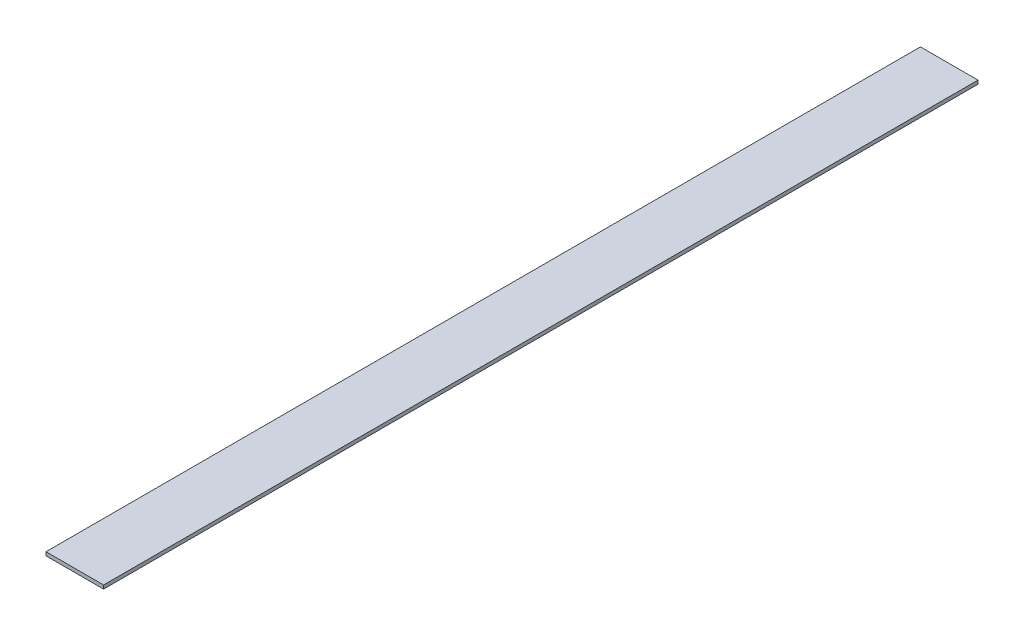
ISO-10303-21;
HEADER;
FILE_DESCRIPTION(('STEP AP214'),'2;1');
FILE_NAME('part.step','',(''),(''),'','','');
FILE_SCHEMA(('AUTOMOTIVE_DESIGN { 1 0 10303 214 1 1 1 1 }'));
ENDSEC;
DATA;
#1=APPLICATION_CONTEXT('core data for automotive mechanical design processes');
#2=APPLICATION_PROTOCOL_DEFINITION('international standard','automotive_design',2000,#1);
#3=PRODUCT_CONTEXT('',#1,'mechanical');
#4=PRODUCT('Part','Part','',(#3));
#5=PRODUCT_RELATED_PRODUCT_CATEGORY('part','',(#4));
#6=PRODUCT_DEFINITION_FORMATION('','',#4);
#7=PRODUCT_DEFINITION_CONTEXT('part definition',#1,'design');
#8=PRODUCT_DEFINITION('design','',#6,#7);
#9=PRODUCT_DEFINITION_SHAPE('','',#8);
#10=(LENGTH_UNIT() NAMED_UNIT(*) SI_UNIT(.MILLI.,.METRE.));
#11=(NAMED_UNIT(*) PLANE_ANGLE_UNIT() SI_UNIT($,.RADIAN.));
#12=(NAMED_UNIT(*) SI_UNIT($,.STERADIAN.) SOLID_ANGLE_UNIT());
#13=UNCERTAINTY_MEASURE_WITH_UNIT(LENGTH_MEASURE(1.E-05),#10,'distance_accuracy_value','');
#14=(GEOMETRIC_REPRESENTATION_CONTEXT(3) GLOBAL_UNCERTAINTY_ASSIGNED_CONTEXT((#13)) GLOBAL_UNIT_ASSIGNED_CONTEXT((#10,
#11,#12)) REPRESENTATION_CONTEXT('',''));
#15=CARTESIAN_POINT('',(0.,0.,0.));
#16=DIRECTION('',(0.,0.,1.));
#17=DIRECTION('',(1.,0.,0.));
#18=AXIS2_PLACEMENT_3D('',#15,#16,#17);
#19=CARTESIAN_POINT('',(0.,3.175,0.));
#20=DIRECTION('',(0.,1.,0.));
#21=DIRECTION('',(0.,0.,1.));
#22=AXIS2_PLACEMENT_3D('',#19,#20,#21);
#23=PLANE('',#22);
#24=DIRECTION('',(-1.,0.,0.));
#25=VECTOR('',#24,1.);
#26=CARTESIAN_POINT('',(25.4,3.175,-379.4125));
#27=LINE('',#26,#25);
#28=CARTESIAN_POINT('',(-25.4,3.175,-379.4125));
#29=VERTEX_POINT('',#28);
#30=CARTESIAN_POINT('',(25.4,3.175,-379.4125));
#31=VERTEX_POINT('',#30);
#32=EDGE_CURVE('E67',#29,#31,#27,.F.);
#33=ORIENTED_EDGE('',*,*,#32,.F.);
#34=DIRECTION('',(0.,0.,1.));
#35=VECTOR('',#34,1.);
#36=CARTESIAN_POINT('',(-25.4,3.175,-379.4125));
#37=LINE('',#36,#35);
#38=CARTESIAN_POINT('',(-25.4,3.175,392.1125));
#39=VERTEX_POINT('',#38);
#40=EDGE_CURVE('E19',#39,#29,#37,.F.);
#41=ORIENTED_EDGE('',*,*,#40,.F.);
#42=DIRECTION('',(1.,0.,0.));
#43=VECTOR('',#42,1.);
#44=CARTESIAN_POINT('',(-25.4,3.175,392.1125));
#45=LINE('',#44,#43);
#46=CARTESIAN_POINT('',(25.4,3.175,392.1125));
#47=VERTEX_POINT('',#46);
#48=EDGE_CURVE('E57',#47,#39,#45,.F.);
#49=ORIENTED_EDGE('',*,*,#48,.F.);
#50=DIRECTION('',(0.,0.,-1.));
#51=VECTOR('',#50,1.);
#52=CARTESIAN_POINT('',(25.4,3.175,392.1125));
#53=LINE('',#52,#51);
#54=EDGE_CURVE('E52',#31,#47,#53,.F.);
#55=ORIENTED_EDGE('',*,*,#54,.F.);
#56=EDGE_LOOP('',(#33,#41,#49,#55));
#57=FACE_BOUND('',#56,.T.);
#58=ADVANCED_FACE('F16',(#57),#23,.T.);
#59=CARTESIAN_POINT('',(-25.4,0.,-379.4125));
#60=DIRECTION('',(-1.,0.,0.));
#61=DIRECTION('',(0.,0.,1.));
#62=AXIS2_PLACEMENT_3D('',#59,#60,#61);
#63=PLANE('',#62);
#64=DIRECTION('',(0.,1.,0.));
#65=VECTOR('',#64,1.);
#66=CARTESIAN_POINT('',(-25.4,0.,-379.4125));
#67=LINE('',#66,#65);
#68=CARTESIAN_POINT('',(-25.4,0.,-379.4125));
#69=VERTEX_POINT('',#68);
#70=EDGE_CURVE('E78',#69,#29,#67,.T.);
#71=ORIENTED_EDGE('',*,*,#70,.F.);
#72=DIRECTION('',(0.,0.,1.));
#73=VECTOR('',#72,1.);
#74=CARTESIAN_POINT('',(-25.4,0.,0.));
#75=LINE('',#74,#73);
#76=CARTESIAN_POINT('',(-25.4,0.,392.1125));
#77=VERTEX_POINT('',#76);
#78=EDGE_CURVE('E73',#69,#77,#75,.T.);
#79=ORIENTED_EDGE('',*,*,#78,.T.);
#80=DIRECTION('',(0.,1.,0.));
#81=VECTOR('',#80,1.);
#82=CARTESIAN_POINT('',(-25.4,0.,392.1125));
#83=LINE('',#82,#81);
#84=EDGE_CURVE('E62',#39,#77,#83,.F.);
#85=ORIENTED_EDGE('',*,*,#84,.F.);
#86=ORIENTED_EDGE('',*,*,#40,.T.);
#87=EDGE_LOOP('',(#71,#79,#85,#86));
#88=FACE_BOUND('',#87,.T.);
#89=ADVANCED_FACE('F72',(#88),#63,.T.);
#90=CARTESIAN_POINT('',(-25.4,0.,392.1125));
#91=DIRECTION('',(0.,0.,1.));
#92=DIRECTION('',(1.,0.,0.));
#93=AXIS2_PLACEMENT_3D('',#90,#91,#92);
#94=PLANE('',#93);
#95=ORIENTED_EDGE('',*,*,#84,.T.);
#96=DIRECTION('',(1.,0.,0.));
#97=VECTOR('',#96,1.);
#98=CARTESIAN_POINT('',(0.,0.,392.1125));
#99=LINE('',#98,#97);
#100=CARTESIAN_POINT('',(25.4,0.,392.1125));
#101=VERTEX_POINT('',#100);
#102=EDGE_CURVE('E83',#77,#101,#99,.T.);
#103=ORIENTED_EDGE('',*,*,#102,.T.);
#104=DIRECTION('',(0.,1.,0.));
#105=VECTOR('',#104,1.);
#106=CARTESIAN_POINT('',(25.4,0.,392.1125));
#107=LINE('',#106,#105);
#108=EDGE_CURVE('E64',#47,#101,#107,.F.);
#109=ORIENTED_EDGE('',*,*,#108,.F.);
#110=ORIENTED_EDGE('',*,*,#48,.T.);
#111=EDGE_LOOP('',(#95,#103,#109,#110));
#112=FACE_BOUND('',#111,.T.);
#113=ADVANCED_FACE('F59',(#112),#94,.T.);
#114=CARTESIAN_POINT('',(25.4,0.,392.1125));
#115=DIRECTION('',(1.,0.,0.));
#116=DIRECTION('',(0.,0.,-1.));
#117=AXIS2_PLACEMENT_3D('',#114,#115,#116);
#118=PLANE('',#117);
#119=ORIENTED_EDGE('',*,*,#108,.T.);
#120=DIRECTION('',(0.,0.,1.));
#121=VECTOR('',#120,1.);
#122=CARTESIAN_POINT('',(25.4,0.,0.));
#123=LINE('',#122,#121);
#124=CARTESIAN_POINT('',(25.4,0.,-379.4125));
#125=VERTEX_POINT('',#124);
#126=EDGE_CURVE('E25',#101,#125,#123,.F.);
#127=ORIENTED_EDGE('',*,*,#126,.T.);
#128=DIRECTION('',(0.,1.,0.));
#129=VECTOR('',#128,1.);
#130=CARTESIAN_POINT('',(25.4,0.,-379.4125));
#131=LINE('',#130,#129);
#132=EDGE_CURVE('E33',#31,#125,#131,.F.);
#133=ORIENTED_EDGE('',*,*,#132,.F.);
#134=ORIENTED_EDGE('',*,*,#54,.T.);
#135=EDGE_LOOP('',(#119,#127,#133,#134));
#136=FACE_BOUND('',#135,.T.);
#137=ADVANCED_FACE('F87',(#136),#118,.T.);
#138=CARTESIAN_POINT('',(25.4,0.,-379.4125));
#139=DIRECTION('',(0.,0.,-1.));
#140=DIRECTION('',(-1.,0.,0.));
#141=AXIS2_PLACEMENT_3D('',#138,#139,#140);
#142=PLANE('',#141);
#143=ORIENTED_EDGE('',*,*,#132,.T.);
#144=DIRECTION('',(1.,0.,0.));
#145=VECTOR('',#144,1.);
#146=CARTESIAN_POINT('',(0.,0.,-379.4125));
#147=LINE('',#146,#145);
#148=EDGE_CURVE('E11',#125,#69,#147,.F.);
#149=ORIENTED_EDGE('',*,*,#148,.T.);
#150=ORIENTED_EDGE('',*,*,#70,.T.);
#151=ORIENTED_EDGE('',*,*,#32,.T.);
#152=EDGE_LOOP('',(#143,#149,#150,#151));
#153=FACE_BOUND('',#152,.T.);
#154=ADVANCED_FACE('F90',(#153),#142,.T.);
#155=CARTESIAN_POINT('',(0.,0.,0.));
#156=DIRECTION('',(0.,1.,0.));
#157=DIRECTION('',(0.,0.,1.));
#158=AXIS2_PLACEMENT_3D('',#155,#156,#157);
#159=PLANE('',#158);
#160=ORIENTED_EDGE('',*,*,#126,.F.);
#161=ORIENTED_EDGE('',*,*,#102,.F.);
#162=ORIENTED_EDGE('',*,*,#78,.F.);
#163=ORIENTED_EDGE('',*,*,#148,.F.);
#164=EDGE_LOOP('',(#160,#161,#162,#163));
#165=FACE_BOUND('',#164,.T.);
#166=ADVANCED_FACE('F89',(#165),#159,.F.);
#167=CLOSED_SHELL('',(#58,#89,#113,#137,#154,#166));
#168=MANIFOLD_SOLID_BREP('B1',#167);
#169=ADVANCED_BREP_SHAPE_REPRESENTATION('',(#18,#168),#14);
#170=SHAPE_DEFINITION_REPRESENTATION(#9,#169);
ENDSEC;
END-ISO-10303-21;
